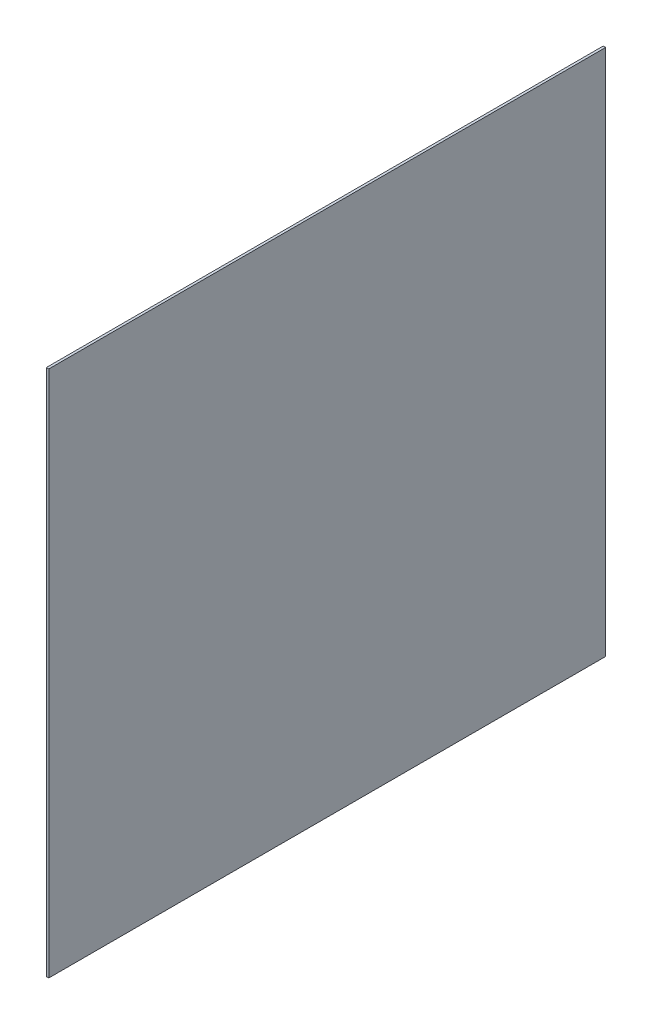
ISO-10303-21;
HEADER;
FILE_DESCRIPTION(('STEP AP214'),'2;1');
FILE_NAME('part.step','',(''),(''),'','','');
FILE_SCHEMA(('AUTOMOTIVE_DESIGN { 1 0 10303 214 1 1 1 1 }'));
ENDSEC;
DATA;
#1=APPLICATION_CONTEXT('core data for automotive mechanical design processes');
#2=APPLICATION_PROTOCOL_DEFINITION('international standard','automotive_design',2000,#1);
#3=PRODUCT_CONTEXT('',#1,'mechanical');
#4=PRODUCT('Part','Part','',(#3));
#5=PRODUCT_RELATED_PRODUCT_CATEGORY('part','',(#4));
#6=PRODUCT_DEFINITION_FORMATION('','',#4);
#7=PRODUCT_DEFINITION_CONTEXT('part definition',#1,'design');
#8=PRODUCT_DEFINITION('design','',#6,#7);
#9=PRODUCT_DEFINITION_SHAPE('','',#8);
#10=(LENGTH_UNIT() NAMED_UNIT(*) SI_UNIT(.MILLI.,.METRE.));
#11=(NAMED_UNIT(*) PLANE_ANGLE_UNIT() SI_UNIT($,.RADIAN.));
#12=(NAMED_UNIT(*) SI_UNIT($,.STERADIAN.) SOLID_ANGLE_UNIT());
#13=UNCERTAINTY_MEASURE_WITH_UNIT(LENGTH_MEASURE(1.E-05),#10,'distance_accuracy_value','');
#14=(GEOMETRIC_REPRESENTATION_CONTEXT(3) GLOBAL_UNCERTAINTY_ASSIGNED_CONTEXT((#13)) GLOBAL_UNIT_ASSIGNED_CONTEXT((#10,
#11,#12)) REPRESENTATION_CONTEXT('',''));
#15=CARTESIAN_POINT('',(0.,0.,0.));
#16=DIRECTION('',(0.,0.,1.));
#17=DIRECTION('',(1.,0.,0.));
#18=AXIS2_PLACEMENT_3D('',#15,#16,#17);
#19=CARTESIAN_POINT('',(2.,205.756684491979,345.242082368642));
#20=DIRECTION('',(0.,0.,-1.));
#21=DIRECTION('',(0.,1.,0.));
#22=AXIS2_PLACEMENT_3D('',#19,#20,#21);
#23=PLANE('',#22);
#24=DIRECTION('',(0.,-1.,0.));
#25=VECTOR('',#24,1.);
#26=CARTESIAN_POINT('',(0.,205.756684491979,345.242082368642));
#27=LINE('',#26,#25);
#28=CARTESIAN_POINT('',(0.,205.756684491979,345.242082368642));
#29=VERTEX_POINT('',#28);
#30=CARTESIAN_POINT('',(0.,-224.243315508021,345.242082368642));
#31=VERTEX_POINT('',#30);
#32=EDGE_CURVE('E107',#29,#31,#27,.T.);
#33=ORIENTED_EDGE('',*,*,#32,.T.);
#34=DIRECTION('',(-1.,0.,0.));
#35=VECTOR('',#34,1.);
#36=CARTESIAN_POINT('',(2.,-224.243315508021,345.242082368642));
#37=LINE('',#36,#35);
#38=CARTESIAN_POINT('',(2.,-224.243315508021,345.242082368642));
#39=VERTEX_POINT('',#38);
#40=EDGE_CURVE('E11',#39,#31,#37,.T.);
#41=ORIENTED_EDGE('',*,*,#40,.F.);
#42=DIRECTION('',(0.,-1.,0.));
#43=VECTOR('',#42,1.);
#44=CARTESIAN_POINT('',(2.,205.756684491979,345.242082368642));
#45=LINE('',#44,#43);
#46=CARTESIAN_POINT('',(2.,205.756684491979,345.242082368642));
#47=VERTEX_POINT('',#46);
#48=EDGE_CURVE('E91',#47,#39,#45,.T.);
#49=ORIENTED_EDGE('',*,*,#48,.F.);
#50=DIRECTION('',(-1.,0.,0.));
#51=VECTOR('',#50,1.);
#52=CARTESIAN_POINT('',(2.,205.756684491979,345.242082368642));
#53=LINE('',#52,#51);
#54=EDGE_CURVE('E103',#47,#29,#53,.T.);
#55=ORIENTED_EDGE('',*,*,#54,.T.);
#56=EDGE_LOOP('',(#33,#41,#49,#55));
#57=FACE_BOUND('',#56,.T.);
#58=ADVANCED_FACE('F39',(#57),#23,.F.);
#59=CARTESIAN_POINT('',(2.,-224.243315508021,345.242082368642));
#60=DIRECTION('',(0.,1.,0.));
#61=DIRECTION('',(0.,0.,1.));
#62=AXIS2_PLACEMENT_3D('',#59,#60,#61);
#63=PLANE('',#62);
#64=DIRECTION('',(0.,0.,-1.));
#65=VECTOR('',#64,1.);
#66=CARTESIAN_POINT('',(0.,-224.243315508021,345.242082368642));
#67=LINE('',#66,#65);
#68=CARTESIAN_POINT('',(0.,-224.243315508021,-108.757917631358));
#69=VERTEX_POINT('',#68);
#70=EDGE_CURVE('E96',#31,#69,#67,.T.);
#71=ORIENTED_EDGE('',*,*,#70,.T.);
#72=DIRECTION('',(-1.,0.,0.));
#73=VECTOR('',#72,1.);
#74=CARTESIAN_POINT('',(2.,-224.243315508021,-108.757917631358));
#75=LINE('',#74,#73);
#76=CARTESIAN_POINT('',(2.,-224.243315508021,-108.757917631358));
#77=VERTEX_POINT('',#76);
#78=EDGE_CURVE('E48',#77,#69,#75,.T.);
#79=ORIENTED_EDGE('',*,*,#78,.F.);
#80=DIRECTION('',(0.,0.,-1.));
#81=VECTOR('',#80,1.);
#82=CARTESIAN_POINT('',(2.,-224.243315508021,345.242082368642));
#83=LINE('',#82,#81);
#84=EDGE_CURVE('E86',#39,#77,#83,.T.);
#85=ORIENTED_EDGE('',*,*,#84,.F.);
#86=ORIENTED_EDGE('',*,*,#40,.T.);
#87=EDGE_LOOP('',(#71,#79,#85,#86));
#88=FACE_BOUND('',#87,.T.);
#89=ADVANCED_FACE('F95',(#88),#63,.F.);
#90=CARTESIAN_POINT('',(2.,205.756684491979,-108.757917631358));
#91=DIRECTION('',(0.,0.,1.));
#92=DIRECTION('',(0.,-1.,0.));
#93=AXIS2_PLACEMENT_3D('',#90,#91,#92);
#94=PLANE('',#93);
#95=DIRECTION('',(0.,1.,0.));
#96=VECTOR('',#95,1.);
#97=CARTESIAN_POINT('',(0.,205.756684491979,-108.757917631358));
#98=LINE('',#97,#96);
#99=CARTESIAN_POINT('',(0.,205.756684491979,-108.757917631358));
#100=VERTEX_POINT('',#99);
#101=EDGE_CURVE('E73',#69,#100,#98,.T.);
#102=ORIENTED_EDGE('',*,*,#101,.T.);
#103=DIRECTION('',(-1.,0.,0.));
#104=VECTOR('',#103,1.);
#105=CARTESIAN_POINT('',(2.,205.756684491979,-108.757917631358));
#106=LINE('',#105,#104);
#107=CARTESIAN_POINT('',(2.,205.756684491979,-108.757917631358));
#108=VERTEX_POINT('',#107);
#109=EDGE_CURVE('E98',#108,#100,#106,.T.);
#110=ORIENTED_EDGE('',*,*,#109,.F.);
#111=DIRECTION('',(0.,1.,0.));
#112=VECTOR('',#111,1.);
#113=CARTESIAN_POINT('',(2.,205.756684491979,-108.757917631358));
#114=LINE('',#113,#112);
#115=EDGE_CURVE('E89',#77,#108,#114,.T.);
#116=ORIENTED_EDGE('',*,*,#115,.F.);
#117=ORIENTED_EDGE('',*,*,#78,.T.);
#118=EDGE_LOOP('',(#102,#110,#116,#117));
#119=FACE_BOUND('',#118,.T.);
#120=ADVANCED_FACE('F99',(#119),#94,.F.);
#121=CARTESIAN_POINT('',(2.,205.756684491979,345.242082368642));
#122=DIRECTION('',(0.,-1.,0.));
#123=DIRECTION('',(0.,0.,-1.));
#124=AXIS2_PLACEMENT_3D('',#121,#122,#123);
#125=PLANE('',#124);
#126=DIRECTION('',(0.,0.,1.));
#127=VECTOR('',#126,1.);
#128=CARTESIAN_POINT('',(0.,205.756684491979,345.242082368642));
#129=LINE('',#128,#127);
#130=EDGE_CURVE('E79',#100,#29,#129,.T.);
#131=ORIENTED_EDGE('',*,*,#130,.T.);
#132=ORIENTED_EDGE('',*,*,#54,.F.);
#133=DIRECTION('',(0.,0.,1.));
#134=VECTOR('',#133,1.);
#135=CARTESIAN_POINT('',(2.,205.756684491979,345.242082368642));
#136=LINE('',#135,#134);
#137=EDGE_CURVE('E56',#108,#47,#136,.T.);
#138=ORIENTED_EDGE('',*,*,#137,.F.);
#139=ORIENTED_EDGE('',*,*,#109,.T.);
#140=EDGE_LOOP('',(#131,#132,#138,#139));
#141=FACE_BOUND('',#140,.T.);
#142=ADVANCED_FACE('F120',(#141),#125,.F.);
#143=CARTESIAN_POINT('',(2.,0.,0.));
#144=DIRECTION('',(1.,0.,0.));
#145=DIRECTION('',(0.,0.,-1.));
#146=AXIS2_PLACEMENT_3D('',#143,#144,#145);
#147=PLANE('',#146);
#148=ORIENTED_EDGE('',*,*,#48,.T.);
#149=ORIENTED_EDGE('',*,*,#84,.T.);
#150=ORIENTED_EDGE('',*,*,#115,.T.);
#151=ORIENTED_EDGE('',*,*,#137,.T.);
#152=EDGE_LOOP('',(#148,#149,#150,#151));
#153=FACE_BOUND('',#152,.T.);
#154=ADVANCED_FACE('F87',(#153),#147,.T.);
#155=CARTESIAN_POINT('',(0.,0.,0.));
#156=DIRECTION('',(1.,0.,0.));
#157=DIRECTION('',(0.,0.,-1.));
#158=AXIS2_PLACEMENT_3D('',#155,#156,#157);
#159=PLANE('',#158);
#160=ORIENTED_EDGE('',*,*,#32,.F.);
#161=ORIENTED_EDGE('',*,*,#130,.F.);
#162=ORIENTED_EDGE('',*,*,#101,.F.);
#163=ORIENTED_EDGE('',*,*,#70,.F.);
#164=EDGE_LOOP('',(#160,#161,#162,#163));
#165=FACE_BOUND('',#164,.T.);
#166=ADVANCED_FACE('F123',(#165),#159,.F.);
#167=CLOSED_SHELL('',(#58,#89,#120,#142,#154,#166));
#168=MANIFOLD_SOLID_BREP('B2',#167);
#169=ADVANCED_BREP_SHAPE_REPRESENTATION('',(#18,#168),#14);
#170=SHAPE_DEFINITION_REPRESENTATION(#9,#169);
ENDSEC;
END-ISO-10303-21;
